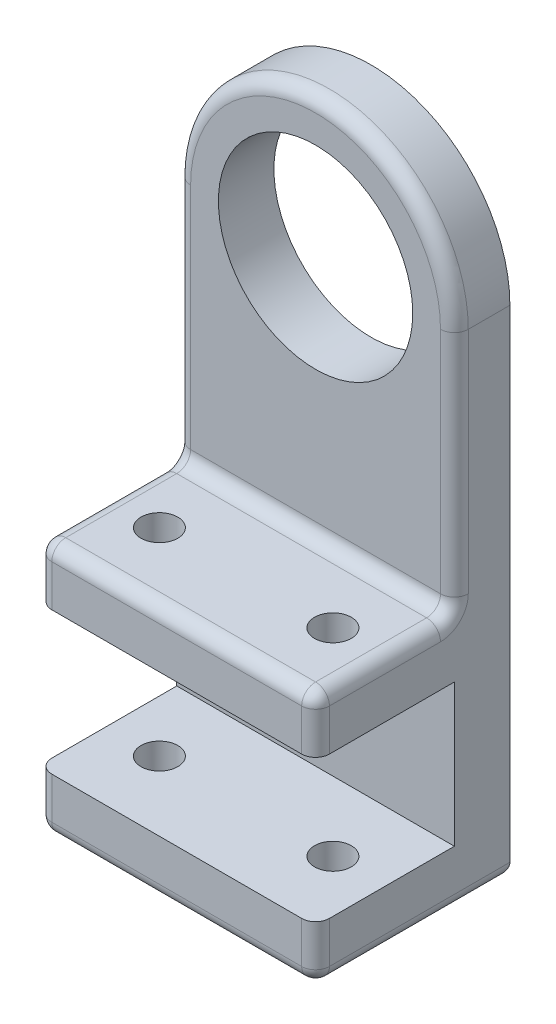
ISO-10303-21;
HEADER;
FILE_DESCRIPTION(('STEP AP214'),'2;1');
FILE_NAME('part.step','',(''),(''),'','','');
FILE_SCHEMA(('AUTOMOTIVE_DESIGN { 1 0 10303 214 1 1 1 1 }'));
ENDSEC;
DATA;
#1=APPLICATION_CONTEXT('core data for automotive mechanical design processes');
#2=APPLICATION_PROTOCOL_DEFINITION('international standard','automotive_design',2000,#1);
#3=PRODUCT_CONTEXT('',#1,'mechanical');
#4=PRODUCT('Part','Part','',(#3));
#5=PRODUCT_RELATED_PRODUCT_CATEGORY('part','',(#4));
#6=PRODUCT_DEFINITION_FORMATION('','',#4);
#7=PRODUCT_DEFINITION_CONTEXT('part definition',#1,'design');
#8=PRODUCT_DEFINITION('design','',#6,#7);
#9=PRODUCT_DEFINITION_SHAPE('','',#8);
#10=(LENGTH_UNIT() NAMED_UNIT(*) SI_UNIT(.MILLI.,.METRE.));
#11=(NAMED_UNIT(*) PLANE_ANGLE_UNIT() SI_UNIT($,.RADIAN.));
#12=(NAMED_UNIT(*) SI_UNIT($,.STERADIAN.) SOLID_ANGLE_UNIT());
#13=UNCERTAINTY_MEASURE_WITH_UNIT(LENGTH_MEASURE(1.E-05),#10,'distance_accuracy_value','');
#14=(GEOMETRIC_REPRESENTATION_CONTEXT(3) GLOBAL_UNCERTAINTY_ASSIGNED_CONTEXT((#13)) GLOBAL_UNIT_ASSIGNED_CONTEXT((#10,
#11,#12)) REPRESENTATION_CONTEXT('',''));
#15=CARTESIAN_POINT('',(0.,0.,0.));
#16=DIRECTION('',(0.,0.,1.));
#17=DIRECTION('',(1.,0.,0.));
#18=AXIS2_PLACEMENT_3D('',#15,#16,#17);
#19=CARTESIAN_POINT('',(0.,0.,8.));
#20=DIRECTION('',(0.,0.,-1.));
#21=DIRECTION('',(-1.,0.,0.));
#22=AXIS2_PLACEMENT_3D('',#19,#20,#21);
#23=PLANE('',#22);
#24=DIRECTION('',(-1.,0.,0.));
#25=VECTOR('',#24,1.);
#26=CARTESIAN_POINT('',(20.,-63.5,8.));
#27=LINE('',#26,#25);
#28=CARTESIAN_POINT('',(20.,-63.5,8.));
#29=VERTEX_POINT('',#28);
#30=CARTESIAN_POINT('',(-20.,-63.5,8.));
#31=VERTEX_POINT('',#30);
#32=EDGE_CURVE('E192',#29,#31,#27,.T.);
#33=ORIENTED_EDGE('',*,*,#32,.F.);
#34=DIRECTION('',(0.,1.,0.));
#35=VECTOR('',#34,1.);
#36=CARTESIAN_POINT('',(20.,-71.5,8.));
#37=LINE('',#36,#35);
#38=CARTESIAN_POINT('',(20.,-43.,8.));
#39=VERTEX_POINT('',#38);
#40=EDGE_CURVE('E201',#29,#39,#37,.T.);
#41=ORIENTED_EDGE('',*,*,#40,.T.);
#42=DIRECTION('',(1.,0.,0.));
#43=VECTOR('',#42,1.);
#44=CARTESIAN_POINT('',(-20.,-43.,8.));
#45=LINE('',#44,#43);
#46=CARTESIAN_POINT('',(-20.,-43.,8.));
#47=VERTEX_POINT('',#46);
#48=EDGE_CURVE('E213',#47,#39,#45,.T.);
#49=ORIENTED_EDGE('',*,*,#48,.F.);
#50=DIRECTION('',(0.,-1.,0.));
#51=VECTOR('',#50,1.);
#52=CARTESIAN_POINT('',(-20.,0.,8.));
#53=LINE('',#52,#51);
#54=EDGE_CURVE('E209',#47,#31,#53,.T.);
#55=ORIENTED_EDGE('',*,*,#54,.T.);
#56=EDGE_LOOP('',(#33,#41,#49,#55));
#57=FACE_BOUND('',#56,.T.);
#58=ADVANCED_FACE('F43',(#57),#23,.F.);
#59=CARTESIAN_POINT('',(0.,0.,8.));
#60=DIRECTION('',(0.,0.,-1.));
#61=DIRECTION('',(-1.,0.,0.));
#62=AXIS2_PLACEMENT_3D('',#59,#60,#61);
#63=CIRCLE('',#62,18.);
#64=CARTESIAN_POINT('',(18.,0.,8.));
#65=VERTEX_POINT('',#64);
#66=CARTESIAN_POINT('',(-18.,0.,8.));
#67=VERTEX_POINT('',#66);
#68=EDGE_CURVE('E281',#65,#67,#63,.F.);
#69=ORIENTED_EDGE('',*,*,#68,.T.);
#70=DIRECTION('',(0.,-1.,0.));
#71=VECTOR('',#70,1.);
#72=CARTESIAN_POINT('',(-18.,0.,8.));
#73=LINE('',#72,#71);
#74=CARTESIAN_POINT('',(-18.,-33.,8.));
#75=VERTEX_POINT('',#74);
#76=EDGE_CURVE('E283',#67,#75,#73,.T.);
#77=ORIENTED_EDGE('',*,*,#76,.T.);
#78=DIRECTION('',(-1.,0.,0.));
#79=VECTOR('',#78,1.);
#80=CARTESIAN_POINT('',(20.,-33.,8.));
#81=LINE('',#80,#79);
#82=CARTESIAN_POINT('',(18.,-33.,8.));
#83=VERTEX_POINT('',#82);
#84=EDGE_CURVE('E277',#75,#83,#81,.F.);
#85=ORIENTED_EDGE('',*,*,#84,.T.);
#86=DIRECTION('',(0.,1.,0.));
#87=VECTOR('',#86,1.);
#88=CARTESIAN_POINT('',(18.,0.,8.));
#89=LINE('',#88,#87);
#90=EDGE_CURVE('E279',#83,#65,#89,.T.);
#91=ORIENTED_EDGE('',*,*,#90,.T.);
#92=EDGE_LOOP('',(#69,#77,#85,#91));
#93=FACE_BOUND('',#92,.T.);
#94=CARTESIAN_POINT('',(0.,0.,8.));
#95=DIRECTION('',(0.,0.,1.));
#96=DIRECTION('',(1.,0.,0.));
#97=AXIS2_PLACEMENT_3D('',#94,#95,#96);
#98=CIRCLE('',#97,14.);
#99=CARTESIAN_POINT('',(14.,0.,8.));
#100=VERTEX_POINT('',#99);
#101=EDGE_CURVE('E227',#100,#100,#98,.T.);
#102=ORIENTED_EDGE('',*,*,#101,.F.);
#103=EDGE_LOOP('',(#102));
#104=FACE_BOUND('',#103,.T.);
#105=ADVANCED_FACE('F437',(#93,#104),#23,.F.);
#106=CARTESIAN_POINT('',(0.,0.,0.));
#107=DIRECTION('',(0.,0.,-1.));
#108=DIRECTION('',(-1.,0.,0.));
#109=AXIS2_PLACEMENT_3D('',#106,#107,#108);
#110=PLANE('',#109);
#111=DIRECTION('',(0.,1.,0.));
#112=VECTOR('',#111,1.);
#113=CARTESIAN_POINT('',(20.,-71.5,0.));
#114=LINE('',#113,#112);
#115=CARTESIAN_POINT('',(20.,-69.5,0.));
#116=VERTEX_POINT('',#115);
#117=CARTESIAN_POINT('',(20.,0.,0.));
#118=VERTEX_POINT('',#117);
#119=EDGE_CURVE('E233',#116,#118,#114,.T.);
#120=ORIENTED_EDGE('',*,*,#119,.F.);
#121=DIRECTION('',(1.,0.,0.));
#122=VECTOR('',#121,1.);
#123=CARTESIAN_POINT('',(-20.,-69.5,0.));
#124=LINE('',#123,#122);
#125=CARTESIAN_POINT('',(-20.,-69.5,0.));
#126=VERTEX_POINT('',#125);
#127=EDGE_CURVE('E11',#116,#126,#124,.F.);
#128=ORIENTED_EDGE('',*,*,#127,.T.);
#129=DIRECTION('',(0.,-1.,0.));
#130=VECTOR('',#129,1.);
#131=CARTESIAN_POINT('',(-20.,0.,0.));
#132=LINE('',#131,#130);
#133=CARTESIAN_POINT('',(-20.,0.,0.));
#134=VERTEX_POINT('',#133);
#135=EDGE_CURVE('E237',#134,#126,#132,.T.);
#136=ORIENTED_EDGE('',*,*,#135,.F.);
#137=CARTESIAN_POINT('',(0.,0.,0.));
#138=DIRECTION('',(0.,0.,1.));
#139=DIRECTION('',(-1.,0.,0.));
#140=AXIS2_PLACEMENT_3D('',#137,#138,#139);
#141=CIRCLE('',#140,20.);
#142=EDGE_CURVE('E230',#118,#134,#141,.T.);
#143=ORIENTED_EDGE('',*,*,#142,.F.);
#144=EDGE_LOOP('',(#120,#128,#136,#143));
#145=FACE_BOUND('',#144,.T.);
#146=CARTESIAN_POINT('',(0.,0.,0.));
#147=DIRECTION('',(0.,0.,1.));
#148=DIRECTION('',(1.,0.,0.));
#149=AXIS2_PLACEMENT_3D('',#146,#147,#148);
#150=CIRCLE('',#149,14.);
#151=CARTESIAN_POINT('',(14.,0.,0.));
#152=VERTEX_POINT('',#151);
#153=EDGE_CURVE('E226',#152,#152,#150,.T.);
#154=ORIENTED_EDGE('',*,*,#153,.T.);
#155=EDGE_LOOP('',(#154));
#156=FACE_BOUND('',#155,.T.);
#157=ADVANCED_FACE('F418',(#145,#156),#110,.T.);
#158=CARTESIAN_POINT('',(0.,0.,8.));
#159=DIRECTION('',(0.,0.,-1.));
#160=DIRECTION('',(-1.,0.,0.));
#161=AXIS2_PLACEMENT_3D('',#158,#159,#160);
#162=CYLINDRICAL_SURFACE('',#161,20.);
#163=DIRECTION('',(0.,0.,-1.));
#164=VECTOR('',#163,1.);
#165=CARTESIAN_POINT('',(-20.,0.,8.));
#166=LINE('',#165,#164);
#167=CARTESIAN_POINT('',(-20.,0.,6.));
#168=VERTEX_POINT('',#167);
#169=EDGE_CURVE('E243',#168,#134,#166,.T.);
#170=ORIENTED_EDGE('',*,*,#169,.F.);
#171=CARTESIAN_POINT('',(0.,0.,6.));
#172=DIRECTION('',(0.,0.,-1.));
#173=DIRECTION('',(-1.,0.,0.));
#174=AXIS2_PLACEMENT_3D('',#171,#172,#173);
#175=CIRCLE('',#174,20.);
#176=CARTESIAN_POINT('',(20.,0.,6.));
#177=VERTEX_POINT('',#176);
#178=EDGE_CURVE('E286',#168,#177,#175,.T.);
#179=ORIENTED_EDGE('',*,*,#178,.T.);
#180=DIRECTION('',(0.,0.,-1.));
#181=VECTOR('',#180,1.);
#182=CARTESIAN_POINT('',(20.,0.,8.));
#183=LINE('',#182,#181);
#184=EDGE_CURVE('E208',#177,#118,#183,.T.);
#185=ORIENTED_EDGE('',*,*,#184,.T.);
#186=ORIENTED_EDGE('',*,*,#142,.T.);
#187=EDGE_LOOP('',(#170,#179,#185,#186));
#188=FACE_BOUND('',#187,.T.);
#189=ADVANCED_FACE('F423',(#188),#162,.T.);
#190=CARTESIAN_POINT('',(-20.,0.,8.));
#191=DIRECTION('',(1.,0.,0.));
#192=DIRECTION('',(0.,1.,0.));
#193=AXIS2_PLACEMENT_3D('',#190,#191,#192);
#194=PLANE('',#193);
#195=ORIENTED_EDGE('',*,*,#135,.T.);
#196=DIRECTION('',(0.,0.,-1.));
#197=VECTOR('',#196,1.);
#198=CARTESIAN_POINT('',(-20.,-69.5,8.));
#199=LINE('',#198,#197);
#200=CARTESIAN_POINT('',(-20.,-69.5,26.));
#201=VERTEX_POINT('',#200);
#202=EDGE_CURVE('E265',#126,#201,#199,.F.);
#203=ORIENTED_EDGE('',*,*,#202,.T.);
#204=DIRECTION('',(0.,-1.,0.));
#205=VECTOR('',#204,1.);
#206=CARTESIAN_POINT('',(-20.,-63.5,26.));
#207=LINE('',#206,#205);
#208=CARTESIAN_POINT('',(-20.,-63.5,26.));
#209=VERTEX_POINT('',#208);
#210=EDGE_CURVE('E263',#201,#209,#207,.F.);
#211=ORIENTED_EDGE('',*,*,#210,.T.);
#212=DIRECTION('',(0.,0.,-1.));
#213=VECTOR('',#212,1.);
#214=CARTESIAN_POINT('',(-20.,-63.5,28.));
#215=LINE('',#214,#213);
#216=EDGE_CURVE('E197',#209,#31,#215,.T.);
#217=ORIENTED_EDGE('',*,*,#216,.T.);
#218=ORIENTED_EDGE('',*,*,#54,.F.);
#219=DIRECTION('',(0.,0.,-1.));
#220=VECTOR('',#219,1.);
#221=CARTESIAN_POINT('',(-20.,-43.,28.));
#222=LINE('',#221,#220);
#223=CARTESIAN_POINT('',(-20.,-43.,26.));
#224=VERTEX_POINT('',#223);
#225=EDGE_CURVE('E224',#224,#47,#222,.T.);
#226=ORIENTED_EDGE('',*,*,#225,.F.);
#227=DIRECTION('',(0.,-1.,0.));
#228=VECTOR('',#227,1.);
#229=CARTESIAN_POINT('',(-20.,-35.,26.));
#230=LINE('',#229,#228);
#231=CARTESIAN_POINT('',(-20.,-37.,26.));
#232=VERTEX_POINT('',#231);
#233=EDGE_CURVE('E245',#224,#232,#230,.F.);
#234=ORIENTED_EDGE('',*,*,#233,.T.);
#235=DIRECTION('',(0.,0.,-1.));
#236=VECTOR('',#235,1.);
#237=CARTESIAN_POINT('',(-20.,-37.,8.));
#238=LINE('',#237,#236);
#239=CARTESIAN_POINT('',(-20.,-37.,10.));
#240=VERTEX_POINT('',#239);
#241=EDGE_CURVE('E255',#232,#240,#238,.T.);
#242=ORIENTED_EDGE('',*,*,#241,.T.);
#243=CARTESIAN_POINT('',(-20.,-33.,10.));
#244=DIRECTION('',(1.,0.,0.));
#245=DIRECTION('',(0.,1.,0.));
#246=AXIS2_PLACEMENT_3D('',#243,#244,#245);
#247=CIRCLE('',#246,4.);
#248=CARTESIAN_POINT('',(-20.,-33.,6.));
#249=VERTEX_POINT('',#248);
#250=EDGE_CURVE('E258',#249,#240,#247,.F.);
#251=ORIENTED_EDGE('',*,*,#250,.F.);
#252=DIRECTION('',(0.,-1.,0.));
#253=VECTOR('',#252,1.);
#254=CARTESIAN_POINT('',(-20.,0.,6.));
#255=LINE('',#254,#253);
#256=EDGE_CURVE('E261',#249,#168,#255,.F.);
#257=ORIENTED_EDGE('',*,*,#256,.T.);
#258=ORIENTED_EDGE('',*,*,#169,.T.);
#259=EDGE_LOOP('',(#195,#203,#211,#217,#218,#226,#234,#242,#251,#257,#258));
#260=FACE_BOUND('',#259,.T.);
#261=ADVANCED_FACE('F488',(#260),#194,.F.);
#262=CARTESIAN_POINT('',(-20.,-71.5,8.));
#263=DIRECTION('',(0.,1.,0.));
#264=DIRECTION('',(0.,0.,1.));
#265=AXIS2_PLACEMENT_3D('',#262,#263,#264);
#266=PLANE('',#265);
#267=DIRECTION('',(1.,0.,0.));
#268=VECTOR('',#267,1.);
#269=CARTESIAN_POINT('',(-20.,-71.5,26.));
#270=LINE('',#269,#268);
#271=CARTESIAN_POINT('',(18.,-71.5,26.));
#272=VERTEX_POINT('',#271);
#273=CARTESIAN_POINT('',(-18.,-71.5,26.));
#274=VERTEX_POINT('',#273);
#275=EDGE_CURVE('E311',#272,#274,#270,.F.);
#276=ORIENTED_EDGE('',*,*,#275,.T.);
#277=DIRECTION('',(0.,0.,-1.));
#278=VECTOR('',#277,1.);
#279=CARTESIAN_POINT('',(-18.,-71.5,8.));
#280=LINE('',#279,#278);
#281=CARTESIAN_POINT('',(-18.,-71.5,2.));
#282=VERTEX_POINT('',#281);
#283=EDGE_CURVE('E313',#274,#282,#280,.T.);
#284=ORIENTED_EDGE('',*,*,#283,.T.);
#285=DIRECTION('',(1.,0.,0.));
#286=VECTOR('',#285,1.);
#287=CARTESIAN_POINT('',(20.,-71.5,2.));
#288=LINE('',#287,#286);
#289=CARTESIAN_POINT('',(18.,-71.5,2.));
#290=VERTEX_POINT('',#289);
#291=EDGE_CURVE('E307',#282,#290,#288,.T.);
#292=ORIENTED_EDGE('',*,*,#291,.T.);
#293=DIRECTION('',(0.,0.,-1.));
#294=VECTOR('',#293,1.);
#295=CARTESIAN_POINT('',(18.,-71.5,8.));
#296=LINE('',#295,#294);
#297=EDGE_CURVE('E309',#290,#272,#296,.F.);
#298=ORIENTED_EDGE('',*,*,#297,.T.);
#299=EDGE_LOOP('',(#276,#284,#292,#298));
#300=FACE_BOUND('',#299,.T.);
#301=CARTESIAN_POINT('',(-12.5,-71.5,18.));
#302=DIRECTION('',(0.,1.,0.));
#303=DIRECTION('',(0.,0.,1.));
#304=AXIS2_PLACEMENT_3D('',#301,#302,#303);
#305=CIRCLE('',#304,2.65);
#306=CARTESIAN_POINT('',(-12.5,-71.5,20.65));
#307=VERTEX_POINT('',#306);
#308=EDGE_CURVE('E250',#307,#307,#305,.T.);
#309=ORIENTED_EDGE('',*,*,#308,.T.);
#310=EDGE_LOOP('',(#309));
#311=FACE_BOUND('',#310,.T.);
#312=CARTESIAN_POINT('',(12.5,-71.5,18.));
#313=DIRECTION('',(0.,1.,0.));
#314=DIRECTION('',(0.,0.,1.));
#315=AXIS2_PLACEMENT_3D('',#312,#313,#314);
#316=CIRCLE('',#315,2.65);
#317=CARTESIAN_POINT('',(12.5,-71.5,20.65));
#318=VERTEX_POINT('',#317);
#319=EDGE_CURVE('E365',#318,#318,#316,.T.);
#320=ORIENTED_EDGE('',*,*,#319,.T.);
#321=EDGE_LOOP('',(#320));
#322=FACE_BOUND('',#321,.T.);
#323=ADVANCED_FACE('F406',(#300,#311,#322),#266,.F.);
#324=CARTESIAN_POINT('',(20.,-71.5,8.));
#325=DIRECTION('',(-1.,0.,0.));
#326=DIRECTION('',(0.,0.,1.));
#327=AXIS2_PLACEMENT_3D('',#324,#325,#326);
#328=PLANE('',#327);
#329=DIRECTION('',(0.,1.,0.));
#330=VECTOR('',#329,1.);
#331=CARTESIAN_POINT('',(20.,-71.5,26.));
#332=LINE('',#331,#330);
#333=CARTESIAN_POINT('',(20.,-63.5,26.));
#334=VERTEX_POINT('',#333);
#335=CARTESIAN_POINT('',(20.,-69.5,26.));
#336=VERTEX_POINT('',#335);
#337=EDGE_CURVE('E297',#334,#336,#332,.F.);
#338=ORIENTED_EDGE('',*,*,#337,.T.);
#339=DIRECTION('',(0.,0.,-1.));
#340=VECTOR('',#339,1.);
#341=CARTESIAN_POINT('',(20.,-69.5,8.));
#342=LINE('',#341,#340);
#343=EDGE_CURVE('E299',#336,#116,#342,.T.);
#344=ORIENTED_EDGE('',*,*,#343,.T.);
#345=ORIENTED_EDGE('',*,*,#119,.T.);
#346=ORIENTED_EDGE('',*,*,#184,.F.);
#347=DIRECTION('',(0.,1.,0.));
#348=VECTOR('',#347,1.);
#349=CARTESIAN_POINT('',(20.,-71.5,6.));
#350=LINE('',#349,#348);
#351=CARTESIAN_POINT('',(20.,-33.,6.));
#352=VERTEX_POINT('',#351);
#353=EDGE_CURVE('E295',#177,#352,#350,.F.);
#354=ORIENTED_EDGE('',*,*,#353,.T.);
#355=CARTESIAN_POINT('',(20.,-33.,10.));
#356=DIRECTION('',(-1.,0.,0.));
#357=DIRECTION('',(0.,0.,1.));
#358=AXIS2_PLACEMENT_3D('',#355,#356,#357);
#359=CIRCLE('',#358,4.);
#360=CARTESIAN_POINT('',(20.,-37.,10.));
#361=VERTEX_POINT('',#360);
#362=EDGE_CURVE('E292',#361,#352,#359,.F.);
#363=ORIENTED_EDGE('',*,*,#362,.F.);
#364=DIRECTION('',(0.,0.,-1.));
#365=VECTOR('',#364,1.);
#366=CARTESIAN_POINT('',(20.,-37.,8.));
#367=LINE('',#366,#365);
#368=CARTESIAN_POINT('',(20.,-37.,26.));
#369=VERTEX_POINT('',#368);
#370=EDGE_CURVE('E290',#361,#369,#367,.F.);
#371=ORIENTED_EDGE('',*,*,#370,.T.);
#372=DIRECTION('',(0.,1.,0.));
#373=VECTOR('',#372,1.);
#374=CARTESIAN_POINT('',(20.,-43.,26.));
#375=LINE('',#374,#373);
#376=CARTESIAN_POINT('',(20.,-43.,26.));
#377=VERTEX_POINT('',#376);
#378=EDGE_CURVE('E288',#369,#377,#375,.F.);
#379=ORIENTED_EDGE('',*,*,#378,.T.);
#380=DIRECTION('',(0.,0.,-1.));
#381=VECTOR('',#380,1.);
#382=CARTESIAN_POINT('',(20.,-43.,28.));
#383=LINE('',#382,#381);
#384=EDGE_CURVE('E204',#377,#39,#383,.T.);
#385=ORIENTED_EDGE('',*,*,#384,.T.);
#386=ORIENTED_EDGE('',*,*,#40,.F.);
#387=DIRECTION('',(0.,0.,-1.));
#388=VECTOR('',#387,1.);
#389=CARTESIAN_POINT('',(20.,-63.5,28.));
#390=LINE('',#389,#388);
#391=EDGE_CURVE('E186',#334,#29,#390,.T.);
#392=ORIENTED_EDGE('',*,*,#391,.F.);
#393=EDGE_LOOP('',(#338,#344,#345,#346,#354,#363,#371,#379,#385,#386,#392));
#394=FACE_BOUND('',#393,.T.);
#395=ADVANCED_FACE('F202',(#394),#328,.F.);
#396=CARTESIAN_POINT('',(0.,0.,8.));
#397=DIRECTION('',(0.,0.,-1.));
#398=DIRECTION('',(-1.,0.,0.));
#399=AXIS2_PLACEMENT_3D('',#396,#397,#398);
#400=CYLINDRICAL_SURFACE('',#399,14.);
#401=ORIENTED_EDGE('',*,*,#101,.T.);
#402=EDGE_LOOP('',(#401));
#403=FACE_BOUND('',#402,.T.);
#404=ORIENTED_EDGE('',*,*,#153,.F.);
#405=EDGE_LOOP('',(#404));
#406=FACE_BOUND('',#405,.T.);
#407=ADVANCED_FACE('F512',(#403,#406),#400,.F.);
#408=CARTESIAN_POINT('',(-20.,-43.,28.));
#409=DIRECTION('',(0.,1.,0.));
#410=DIRECTION('',(0.,0.,1.));
#411=AXIS2_PLACEMENT_3D('',#408,#409,#410);
#412=PLANE('',#411);
#413=CARTESIAN_POINT('',(-12.5,-43.,18.));
#414=DIRECTION('',(0.,1.,0.));
#415=DIRECTION('',(0.,0.,1.));
#416=AXIS2_PLACEMENT_3D('',#413,#414,#415);
#417=CIRCLE('',#416,2.65);
#418=CARTESIAN_POINT('',(-12.5,-43.,20.65));
#419=VERTEX_POINT('',#418);
#420=EDGE_CURVE('E198',#419,#419,#417,.T.);
#421=ORIENTED_EDGE('',*,*,#420,.T.);
#422=EDGE_LOOP('',(#421));
#423=FACE_BOUND('',#422,.T.);
#424=CARTESIAN_POINT('',(12.5,-43.,18.));
#425=DIRECTION('',(0.,1.,0.));
#426=DIRECTION('',(0.,0.,1.));
#427=AXIS2_PLACEMENT_3D('',#424,#425,#426);
#428=CIRCLE('',#427,2.65);
#429=CARTESIAN_POINT('',(12.5,-43.,20.65));
#430=VERTEX_POINT('',#429);
#431=EDGE_CURVE('E249',#430,#430,#428,.T.);
#432=ORIENTED_EDGE('',*,*,#431,.T.);
#433=EDGE_LOOP('',(#432));
#434=FACE_BOUND('',#433,.T.);
#435=ORIENTED_EDGE('',*,*,#384,.F.);
#436=CARTESIAN_POINT('',(18.,-43.,26.));
#437=DIRECTION('',(0.,1.,0.));
#438=DIRECTION('',(0.,0.,1.));
#439=AXIS2_PLACEMENT_3D('',#436,#437,#438);
#440=CIRCLE('',#439,2.);
#441=CARTESIAN_POINT('',(18.,-43.,28.));
#442=VERTEX_POINT('',#441);
#443=EDGE_CURVE('E52',#377,#442,#440,.F.);
#444=ORIENTED_EDGE('',*,*,#443,.T.);
#445=DIRECTION('',(1.,0.,0.));
#446=VECTOR('',#445,1.);
#447=CARTESIAN_POINT('',(-20.,-43.,28.));
#448=LINE('',#447,#446);
#449=CARTESIAN_POINT('',(-18.,-43.,28.));
#450=VERTEX_POINT('',#449);
#451=EDGE_CURVE('E216',#450,#442,#448,.T.);
#452=ORIENTED_EDGE('',*,*,#451,.F.);
#453=CARTESIAN_POINT('',(-18.,-43.,26.));
#454=DIRECTION('',(0.,1.,0.));
#455=DIRECTION('',(0.,0.,1.));
#456=AXIS2_PLACEMENT_3D('',#453,#454,#455);
#457=CIRCLE('',#456,2.);
#458=EDGE_CURVE('E323',#450,#224,#457,.F.);
#459=ORIENTED_EDGE('',*,*,#458,.T.);
#460=ORIENTED_EDGE('',*,*,#225,.T.);
#461=ORIENTED_EDGE('',*,*,#48,.T.);
#462=EDGE_LOOP('',(#435,#444,#452,#459,#460,#461));
#463=FACE_BOUND('',#462,.T.);
#464=ADVANCED_FACE('F467',(#423,#434,#463),#412,.F.);
#465=CARTESIAN_POINT('',(-20.,-35.,28.));
#466=DIRECTION('',(0.,-1.,0.));
#467=DIRECTION('',(0.,0.,-1.));
#468=AXIS2_PLACEMENT_3D('',#465,#466,#467);
#469=PLANE('',#468);
#470=DIRECTION('',(-1.,0.,0.));
#471=VECTOR('',#470,1.);
#472=CARTESIAN_POINT('',(-20.,-35.,10.));
#473=LINE('',#472,#471);
#474=CARTESIAN_POINT('',(18.,-35.,10.));
#475=VERTEX_POINT('',#474);
#476=CARTESIAN_POINT('',(-18.,-35.,10.));
#477=VERTEX_POINT('',#476);
#478=EDGE_CURVE('E268',#475,#477,#473,.T.);
#479=ORIENTED_EDGE('',*,*,#478,.T.);
#480=DIRECTION('',(0.,0.,-1.));
#481=VECTOR('',#480,1.);
#482=CARTESIAN_POINT('',(-18.,-35.,28.));
#483=LINE('',#482,#481);
#484=CARTESIAN_POINT('',(-18.,-35.,26.));
#485=VERTEX_POINT('',#484);
#486=EDGE_CURVE('E274',#477,#485,#483,.F.);
#487=ORIENTED_EDGE('',*,*,#486,.T.);
#488=DIRECTION('',(-1.,0.,0.));
#489=VECTOR('',#488,1.);
#490=CARTESIAN_POINT('',(20.,-35.,26.));
#491=LINE('',#490,#489);
#492=CARTESIAN_POINT('',(18.,-35.,26.));
#493=VERTEX_POINT('',#492);
#494=EDGE_CURVE('E272',#485,#493,#491,.F.);
#495=ORIENTED_EDGE('',*,*,#494,.T.);
#496=DIRECTION('',(0.,0.,-1.));
#497=VECTOR('',#496,1.);
#498=CARTESIAN_POINT('',(18.,-35.,28.));
#499=LINE('',#498,#497);
#500=EDGE_CURVE('E270',#493,#475,#499,.T.);
#501=ORIENTED_EDGE('',*,*,#500,.T.);
#502=EDGE_LOOP('',(#479,#487,#495,#501));
#503=FACE_BOUND('',#502,.T.);
#504=CARTESIAN_POINT('',(-12.5,-35.,18.));
#505=DIRECTION('',(0.,1.,0.));
#506=DIRECTION('',(0.,0.,1.));
#507=AXIS2_PLACEMENT_3D('',#504,#505,#506);
#508=CIRCLE('',#507,2.65);
#509=CARTESIAN_POINT('',(-12.5,-35.,20.65));
#510=VERTEX_POINT('',#509);
#511=EDGE_CURVE('E615',#510,#510,#508,.T.);
#512=ORIENTED_EDGE('',*,*,#511,.F.);
#513=EDGE_LOOP('',(#512));
#514=FACE_BOUND('',#513,.T.);
#515=CARTESIAN_POINT('',(12.5,-35.,18.));
#516=DIRECTION('',(0.,1.,0.));
#517=DIRECTION('',(0.,0.,1.));
#518=AXIS2_PLACEMENT_3D('',#515,#516,#517);
#519=CIRCLE('',#518,2.65);
#520=CARTESIAN_POINT('',(12.5,-35.,20.65));
#521=VERTEX_POINT('',#520);
#522=EDGE_CURVE('E612',#521,#521,#519,.T.);
#523=ORIENTED_EDGE('',*,*,#522,.F.);
#524=EDGE_LOOP('',(#523));
#525=FACE_BOUND('',#524,.T.);
#526=ADVANCED_FACE('F449',(#503,#514,#525),#469,.F.);
#527=CARTESIAN_POINT('',(0.,0.,28.));
#528=DIRECTION('',(0.,0.,1.));
#529=DIRECTION('',(1.,0.,0.));
#530=AXIS2_PLACEMENT_3D('',#527,#528,#529);
#531=PLANE('',#530);
#532=ORIENTED_EDGE('',*,*,#451,.T.);
#533=DIRECTION('',(0.,1.,0.));
#534=VECTOR('',#533,1.);
#535=CARTESIAN_POINT('',(18.,-35.,28.));
#536=LINE('',#535,#534);
#537=CARTESIAN_POINT('',(18.,-37.,28.));
#538=VERTEX_POINT('',#537);
#539=EDGE_CURVE('E305',#442,#538,#536,.T.);
#540=ORIENTED_EDGE('',*,*,#539,.T.);
#541=DIRECTION('',(-1.,0.,0.));
#542=VECTOR('',#541,1.);
#543=CARTESIAN_POINT('',(-20.,-37.,28.));
#544=LINE('',#543,#542);
#545=CARTESIAN_POINT('',(-18.,-37.,28.));
#546=VERTEX_POINT('',#545);
#547=EDGE_CURVE('E303',#538,#546,#544,.T.);
#548=ORIENTED_EDGE('',*,*,#547,.T.);
#549=DIRECTION('',(0.,-1.,0.));
#550=VECTOR('',#549,1.);
#551=CARTESIAN_POINT('',(-18.,-43.,28.));
#552=LINE('',#551,#550);
#553=EDGE_CURVE('E301',#546,#450,#552,.T.);
#554=ORIENTED_EDGE('',*,*,#553,.T.);
#555=EDGE_LOOP('',(#532,#540,#548,#554));
#556=FACE_BOUND('',#555,.T.);
#557=ADVANCED_FACE('F470',(#556),#531,.T.);
#558=CARTESIAN_POINT('',(20.,-63.5,28.));
#559=DIRECTION('',(0.,-1.,0.));
#560=DIRECTION('',(0.,0.,-1.));
#561=AXIS2_PLACEMENT_3D('',#558,#559,#560);
#562=PLANE('',#561);
#563=CARTESIAN_POINT('',(-12.5,-63.5,18.));
#564=DIRECTION('',(0.,-1.,0.));
#565=DIRECTION('',(0.,0.,-1.));
#566=AXIS2_PLACEMENT_3D('',#563,#564,#565);
#567=CIRCLE('',#566,2.65);
#568=CARTESIAN_POINT('',(-12.5,-63.5,15.35));
#569=VERTEX_POINT('',#568);
#570=EDGE_CURVE('E251',#569,#569,#567,.T.);
#571=ORIENTED_EDGE('',*,*,#570,.T.);
#572=EDGE_LOOP('',(#571));
#573=FACE_BOUND('',#572,.T.);
#574=CARTESIAN_POINT('',(12.5,-63.5,18.));
#575=DIRECTION('',(0.,-1.,0.));
#576=DIRECTION('',(0.,0.,-1.));
#577=AXIS2_PLACEMENT_3D('',#574,#575,#576);
#578=CIRCLE('',#577,2.65);
#579=CARTESIAN_POINT('',(12.5,-63.5,15.35));
#580=VERTEX_POINT('',#579);
#581=EDGE_CURVE('E246',#580,#580,#578,.T.);
#582=ORIENTED_EDGE('',*,*,#581,.T.);
#583=EDGE_LOOP('',(#582));
#584=FACE_BOUND('',#583,.T.);
#585=DIRECTION('',(-1.,0.,0.));
#586=VECTOR('',#585,1.);
#587=CARTESIAN_POINT('',(20.,-63.5,28.));
#588=LINE('',#587,#586);
#589=CARTESIAN_POINT('',(18.,-63.5,28.));
#590=VERTEX_POINT('',#589);
#591=CARTESIAN_POINT('',(-18.,-63.5,28.));
#592=VERTEX_POINT('',#591);
#593=EDGE_CURVE('E214',#590,#592,#588,.T.);
#594=ORIENTED_EDGE('',*,*,#593,.F.);
#595=CARTESIAN_POINT('',(18.,-63.5,26.));
#596=DIRECTION('',(0.,-1.,0.));
#597=DIRECTION('',(0.,0.,-1.));
#598=AXIS2_PLACEMENT_3D('',#595,#596,#597);
#599=CIRCLE('',#598,2.);
#600=EDGE_CURVE('E194',#590,#334,#599,.F.);
#601=ORIENTED_EDGE('',*,*,#600,.T.);
#602=ORIENTED_EDGE('',*,*,#391,.T.);
#603=ORIENTED_EDGE('',*,*,#32,.T.);
#604=ORIENTED_EDGE('',*,*,#216,.F.);
#605=CARTESIAN_POINT('',(-18.,-63.5,26.));
#606=DIRECTION('',(0.,-1.,0.));
#607=DIRECTION('',(0.,0.,-1.));
#608=AXIS2_PLACEMENT_3D('',#605,#606,#607);
#609=CIRCLE('',#608,2.);
#610=EDGE_CURVE('E320',#209,#592,#609,.F.);
#611=ORIENTED_EDGE('',*,*,#610,.T.);
#612=EDGE_LOOP('',(#594,#601,#602,#603,#604,#611));
#613=FACE_BOUND('',#612,.T.);
#614=ADVANCED_FACE('F189',(#573,#584,#613),#562,.F.);
#615=CARTESIAN_POINT('',(0.,0.,28.));
#616=DIRECTION('',(0.,0.,1.));
#617=DIRECTION('',(1.,0.,0.));
#618=AXIS2_PLACEMENT_3D('',#615,#616,#617);
#619=PLANE('',#618);
#620=DIRECTION('',(1.,0.,0.));
#621=VECTOR('',#620,1.);
#622=CARTESIAN_POINT('',(20.,-69.5,28.));
#623=LINE('',#622,#621);
#624=CARTESIAN_POINT('',(-18.,-69.5,28.));
#625=VERTEX_POINT('',#624);
#626=CARTESIAN_POINT('',(18.,-69.5,28.));
#627=VERTEX_POINT('',#626);
#628=EDGE_CURVE('E60',#625,#627,#623,.T.);
#629=ORIENTED_EDGE('',*,*,#628,.T.);
#630=DIRECTION('',(0.,1.,0.));
#631=VECTOR('',#630,1.);
#632=CARTESIAN_POINT('',(18.,-63.5,28.));
#633=LINE('',#632,#631);
#634=EDGE_CURVE('E318',#627,#590,#633,.T.);
#635=ORIENTED_EDGE('',*,*,#634,.T.);
#636=ORIENTED_EDGE('',*,*,#593,.T.);
#637=DIRECTION('',(0.,-1.,0.));
#638=VECTOR('',#637,1.);
#639=CARTESIAN_POINT('',(-18.,-71.5,28.));
#640=LINE('',#639,#638);
#641=EDGE_CURVE('E65',#592,#625,#640,.T.);
#642=ORIENTED_EDGE('',*,*,#641,.T.);
#643=EDGE_LOOP('',(#629,#635,#636,#642));
#644=FACE_BOUND('',#643,.T.);
#645=ADVANCED_FACE('F393',(#644),#619,.T.);
#646=CARTESIAN_POINT('',(12.5,-71.5,18.));
#647=DIRECTION('',(0.,1.,0.));
#648=DIRECTION('',(0.,0.,1.));
#649=AXIS2_PLACEMENT_3D('',#646,#647,#648);
#650=CYLINDRICAL_SURFACE('',#649,2.65);
#651=ORIENTED_EDGE('',*,*,#319,.F.);
#652=EDGE_LOOP('',(#651));
#653=FACE_BOUND('',#652,.T.);
#654=ORIENTED_EDGE('',*,*,#581,.F.);
#655=EDGE_LOOP('',(#654));
#656=FACE_BOUND('',#655,.T.);
#657=ADVANCED_FACE('F568',(#653,#656),#650,.F.);
#658=CARTESIAN_POINT('',(-12.5,-71.5,18.));
#659=DIRECTION('',(0.,1.,0.));
#660=DIRECTION('',(0.,0.,1.));
#661=AXIS2_PLACEMENT_3D('',#658,#659,#660);
#662=CYLINDRICAL_SURFACE('',#661,2.65);
#663=ORIENTED_EDGE('',*,*,#308,.F.);
#664=EDGE_LOOP('',(#663));
#665=FACE_BOUND('',#664,.T.);
#666=ORIENTED_EDGE('',*,*,#570,.F.);
#667=EDGE_LOOP('',(#666));
#668=FACE_BOUND('',#667,.T.);
#669=ADVANCED_FACE('F562',(#665,#668),#662,.F.);
#670=ORIENTED_EDGE('',*,*,#522,.T.);
#671=EDGE_LOOP('',(#670));
#672=FACE_BOUND('',#671,.T.);
#673=ORIENTED_EDGE('',*,*,#431,.F.);
#674=EDGE_LOOP('',(#673));
#675=FACE_BOUND('',#674,.T.);
#676=ADVANCED_FACE('F559',(#672,#675),#650,.F.);
#677=ORIENTED_EDGE('',*,*,#511,.T.);
#678=EDGE_LOOP('',(#677));
#679=FACE_BOUND('',#678,.T.);
#680=ORIENTED_EDGE('',*,*,#420,.F.);
#681=EDGE_LOOP('',(#680));
#682=FACE_BOUND('',#681,.T.);
#683=ADVANCED_FACE('F555',(#679,#682),#662,.F.);
#684=CARTESIAN_POINT('',(18.,0.,26.));
#685=DIRECTION('',(0.,-1.,0.));
#686=DIRECTION('',(0.,0.,-1.));
#687=AXIS2_PLACEMENT_3D('',#684,#685,#686);
#688=CYLINDRICAL_SURFACE('',#687,2.);
#689=ORIENTED_EDGE('',*,*,#443,.F.);
#690=ORIENTED_EDGE('',*,*,#378,.F.);
#691=CARTESIAN_POINT('',(18.,-37.,26.));
#692=DIRECTION('',(0.,1.,0.));
#693=DIRECTION('',(0.,0.,1.));
#694=AXIS2_PLACEMENT_3D('',#691,#692,#693);
#695=CIRCLE('',#694,2.);
#696=EDGE_CURVE('E359',#538,#369,#695,.T.);
#697=ORIENTED_EDGE('',*,*,#696,.F.);
#698=ORIENTED_EDGE('',*,*,#539,.F.);
#699=EDGE_LOOP('',(#689,#690,#697,#698));
#700=FACE_BOUND('',#699,.T.);
#701=ADVANCED_FACE('F462',(#700),#688,.T.);
#702=CARTESIAN_POINT('',(18.,0.,6.));
#703=DIRECTION('',(0.,1.,0.));
#704=DIRECTION('',(0.,0.,1.));
#705=AXIS2_PLACEMENT_3D('',#702,#703,#704);
#706=CYLINDRICAL_SURFACE('',#705,2.);
#707=CARTESIAN_POINT('',(18.,-33.,6.));
#708=DIRECTION('',(0.,-1.,0.));
#709=DIRECTION('',(0.,0.,-1.));
#710=AXIS2_PLACEMENT_3D('',#707,#708,#709);
#711=CIRCLE('',#710,2.);
#712=EDGE_CURVE('E353',#352,#83,#711,.T.);
#713=ORIENTED_EDGE('',*,*,#712,.F.);
#714=ORIENTED_EDGE('',*,*,#353,.F.);
#715=CARTESIAN_POINT('',(18.,0.,6.));
#716=DIRECTION('',(0.,1.,0.));
#717=DIRECTION('',(0.,0.,1.));
#718=AXIS2_PLACEMENT_3D('',#715,#716,#717);
#719=CIRCLE('',#718,2.);
#720=EDGE_CURVE('E356',#65,#177,#719,.T.);
#721=ORIENTED_EDGE('',*,*,#720,.F.);
#722=ORIENTED_EDGE('',*,*,#90,.F.);
#723=EDGE_LOOP('',(#713,#714,#721,#722));
#724=FACE_BOUND('',#723,.T.);
#725=ADVANCED_FACE('F429',(#724),#706,.T.);
#726=CARTESIAN_POINT('',(18.,-37.,28.));
#727=DIRECTION('',(0.,0.,-1.));
#728=DIRECTION('',(-1.,0.,0.));
#729=AXIS2_PLACEMENT_3D('',#726,#727,#728);
#730=CYLINDRICAL_SURFACE('',#729,2.);
#731=CARTESIAN_POINT('',(18.,-37.,26.));
#732=DIRECTION('',(0.,0.,1.));
#733=DIRECTION('',(1.,0.,0.));
#734=AXIS2_PLACEMENT_3D('',#731,#732,#733);
#735=CIRCLE('',#734,2.);
#736=EDGE_CURVE('E362',#369,#493,#735,.T.);
#737=ORIENTED_EDGE('',*,*,#736,.F.);
#738=ORIENTED_EDGE('',*,*,#370,.F.);
#739=CARTESIAN_POINT('',(18.,-37.,10.));
#740=DIRECTION('',(0.,0.,-1.));
#741=DIRECTION('',(-1.,0.,0.));
#742=AXIS2_PLACEMENT_3D('',#739,#740,#741);
#743=CIRCLE('',#742,2.);
#744=EDGE_CURVE('E350',#475,#361,#743,.T.);
#745=ORIENTED_EDGE('',*,*,#744,.F.);
#746=ORIENTED_EDGE('',*,*,#500,.F.);
#747=EDGE_LOOP('',(#737,#738,#745,#746));
#748=FACE_BOUND('',#747,.T.);
#749=ADVANCED_FACE('F457',(#748),#730,.T.);
#750=CARTESIAN_POINT('',(18.,-37.,26.));
#751=DIRECTION('',(1.,0.,0.));
#752=DIRECTION('',(0.,0.,-1.));
#753=AXIS2_PLACEMENT_3D('',#750,#751,#752);
#754=SPHERICAL_SURFACE('',#753,2.);
#755=ORIENTED_EDGE('',*,*,#696,.T.);
#756=ORIENTED_EDGE('',*,*,#736,.T.);
#757=CARTESIAN_POINT('',(18.,-37.,26.));
#758=DIRECTION('',(1.,0.,0.));
#759=DIRECTION('',(0.,0.,-1.));
#760=AXIS2_PLACEMENT_3D('',#757,#758,#759);
#761=CIRCLE('',#760,2.);
#762=EDGE_CURVE('E347',#538,#493,#761,.F.);
#763=ORIENTED_EDGE('',*,*,#762,.F.);
#764=EDGE_LOOP('',(#755,#756,#763));
#765=FACE_BOUND('',#764,.T.);
#766=ADVANCED_FACE('F546',(#765),#754,.T.);
#767=CARTESIAN_POINT('',(0.,0.,6.));
#768=DIRECTION('',(0.,0.,-1.));
#769=DIRECTION('',(-1.,0.,0.));
#770=AXIS2_PLACEMENT_3D('',#767,#768,#769);
#771=TOROIDAL_SURFACE('',#770,18.,2.);
#772=ORIENTED_EDGE('',*,*,#720,.T.);
#773=ORIENTED_EDGE('',*,*,#178,.F.);
#774=CARTESIAN_POINT('',(-18.,0.,6.));
#775=DIRECTION('',(0.,-1.,0.));
#776=DIRECTION('',(1.,0.,0.));
#777=AXIS2_PLACEMENT_3D('',#774,#775,#776);
#778=CIRCLE('',#777,2.);
#779=EDGE_CURVE('E344',#67,#168,#778,.T.);
#780=ORIENTED_EDGE('',*,*,#779,.F.);
#781=ORIENTED_EDGE('',*,*,#68,.F.);
#782=EDGE_LOOP('',(#772,#773,#780,#781));
#783=FACE_BOUND('',#782,.T.);
#784=ADVANCED_FACE('F433',(#783),#771,.T.);
#785=CARTESIAN_POINT('',(18.,-33.,10.));
#786=DIRECTION('',(-1.,0.,0.));
#787=DIRECTION('',(0.,0.,1.));
#788=AXIS2_PLACEMENT_3D('',#785,#786,#787);
#789=TOROIDAL_SURFACE('',#788,4.,2.);
#790=ORIENTED_EDGE('',*,*,#362,.T.);
#791=ORIENTED_EDGE('',*,*,#712,.T.);
#792=CARTESIAN_POINT('',(18.,-33.,10.));
#793=DIRECTION('',(-1.,0.,0.));
#794=DIRECTION('',(0.,0.,1.));
#795=AXIS2_PLACEMENT_3D('',#792,#793,#794);
#796=CIRCLE('',#795,2.);
#797=EDGE_CURVE('E341',#475,#83,#796,.F.);
#798=ORIENTED_EDGE('',*,*,#797,.F.);
#799=ORIENTED_EDGE('',*,*,#744,.T.);
#800=EDGE_LOOP('',(#790,#791,#798,#799));
#801=FACE_BOUND('',#800,.T.);
#802=ADVANCED_FACE('F442',(#801),#789,.T.);
#803=CARTESIAN_POINT('',(0.,-37.,26.));
#804=DIRECTION('',(1.,0.,0.));
#805=DIRECTION('',(0.,0.,-1.));
#806=AXIS2_PLACEMENT_3D('',#803,#804,#805);
#807=CYLINDRICAL_SURFACE('',#806,2.);
#808=ORIENTED_EDGE('',*,*,#762,.T.);
#809=ORIENTED_EDGE('',*,*,#494,.F.);
#810=CARTESIAN_POINT('',(-18.,-37.,26.));
#811=DIRECTION('',(-1.,0.,0.));
#812=DIRECTION('',(0.,0.,1.));
#813=AXIS2_PLACEMENT_3D('',#810,#811,#812);
#814=CIRCLE('',#813,2.);
#815=EDGE_CURVE('E338',#546,#485,#814,.T.);
#816=ORIENTED_EDGE('',*,*,#815,.F.);
#817=ORIENTED_EDGE('',*,*,#547,.F.);
#818=EDGE_LOOP('',(#808,#809,#816,#817));
#819=FACE_BOUND('',#818,.T.);
#820=ADVANCED_FACE('F480',(#819),#807,.T.);
#821=CARTESIAN_POINT('',(-18.,0.,26.));
#822=DIRECTION('',(0.,1.,0.));
#823=DIRECTION('',(-1.,0.,0.));
#824=AXIS2_PLACEMENT_3D('',#821,#822,#823);
#825=CYLINDRICAL_SURFACE('',#824,2.);
#826=ORIENTED_EDGE('',*,*,#458,.F.);
#827=ORIENTED_EDGE('',*,*,#553,.F.);
#828=CARTESIAN_POINT('',(-18.,-37.,26.));
#829=DIRECTION('',(0.,1.,0.));
#830=DIRECTION('',(0.,0.,1.));
#831=AXIS2_PLACEMENT_3D('',#828,#829,#830);
#832=CIRCLE('',#831,2.);
#833=EDGE_CURVE('E335',#232,#546,#832,.T.);
#834=ORIENTED_EDGE('',*,*,#833,.F.);
#835=ORIENTED_EDGE('',*,*,#233,.F.);
#836=EDGE_LOOP('',(#826,#827,#834,#835));
#837=FACE_BOUND('',#836,.T.);
#838=ADVANCED_FACE('F476',(#837),#825,.T.);
#839=CARTESIAN_POINT('',(-18.,0.,6.));
#840=DIRECTION('',(0.,-1.,0.));
#841=DIRECTION('',(1.,0.,0.));
#842=AXIS2_PLACEMENT_3D('',#839,#840,#841);
#843=CYLINDRICAL_SURFACE('',#842,2.);
#844=ORIENTED_EDGE('',*,*,#779,.T.);
#845=ORIENTED_EDGE('',*,*,#256,.F.);
#846=CARTESIAN_POINT('',(-18.,-33.,6.));
#847=DIRECTION('',(0.,-1.,0.));
#848=DIRECTION('',(0.,0.,-1.));
#849=AXIS2_PLACEMENT_3D('',#846,#847,#848);
#850=CIRCLE('',#849,2.);
#851=EDGE_CURVE('E332',#75,#249,#850,.T.);
#852=ORIENTED_EDGE('',*,*,#851,.F.);
#853=ORIENTED_EDGE('',*,*,#76,.F.);
#854=EDGE_LOOP('',(#844,#845,#852,#853));
#855=FACE_BOUND('',#854,.T.);
#856=ADVANCED_FACE('F534',(#855),#843,.T.);
#857=CARTESIAN_POINT('',(-20.,-33.,10.));
#858=DIRECTION('',(1.,0.,0.));
#859=DIRECTION('',(0.,0.,-1.));
#860=AXIS2_PLACEMENT_3D('',#857,#858,#859);
#861=CYLINDRICAL_SURFACE('',#860,2.);
#862=ORIENTED_EDGE('',*,*,#797,.T.);
#863=ORIENTED_EDGE('',*,*,#84,.F.);
#864=CARTESIAN_POINT('',(-18.,-33.,10.));
#865=DIRECTION('',(1.,0.,0.));
#866=DIRECTION('',(0.,1.,0.));
#867=AXIS2_PLACEMENT_3D('',#864,#865,#866);
#868=CIRCLE('',#867,2.);
#869=EDGE_CURVE('E330',#477,#75,#868,.T.);
#870=ORIENTED_EDGE('',*,*,#869,.F.);
#871=ORIENTED_EDGE('',*,*,#478,.F.);
#872=EDGE_LOOP('',(#862,#863,#870,#871));
#873=FACE_BOUND('',#872,.T.);
#874=ADVANCED_FACE('F445',(#873),#861,.F.);
#875=CARTESIAN_POINT('',(-18.,-37.,26.));
#876=DIRECTION('',(0.,0.,1.));
#877=DIRECTION('',(1.,0.,0.));
#878=AXIS2_PLACEMENT_3D('',#875,#876,#877);
#879=SPHERICAL_SURFACE('',#878,2.);
#880=ORIENTED_EDGE('',*,*,#833,.T.);
#881=ORIENTED_EDGE('',*,*,#815,.T.);
#882=CARTESIAN_POINT('',(-18.,-37.,26.));
#883=DIRECTION('',(0.,0.,1.));
#884=DIRECTION('',(1.,0.,0.));
#885=AXIS2_PLACEMENT_3D('',#882,#883,#884);
#886=CIRCLE('',#885,2.);
#887=EDGE_CURVE('E328',#232,#485,#886,.F.);
#888=ORIENTED_EDGE('',*,*,#887,.F.);
#889=EDGE_LOOP('',(#880,#881,#888));
#890=FACE_BOUND('',#889,.T.);
#891=ADVANCED_FACE('F482',(#890),#879,.T.);
#892=CARTESIAN_POINT('',(-18.,-33.,10.));
#893=DIRECTION('',(1.,0.,0.));
#894=DIRECTION('',(0.,1.,0.));
#895=AXIS2_PLACEMENT_3D('',#892,#893,#894);
#896=TOROIDAL_SURFACE('',#895,4.,2.);
#897=ORIENTED_EDGE('',*,*,#851,.T.);
#898=ORIENTED_EDGE('',*,*,#250,.T.);
#899=CARTESIAN_POINT('',(-18.,-37.,10.));
#900=DIRECTION('',(0.,0.,-1.));
#901=DIRECTION('',(-1.,0.,0.));
#902=AXIS2_PLACEMENT_3D('',#899,#900,#901);
#903=CIRCLE('',#902,2.);
#904=EDGE_CURVE('E326',#477,#240,#903,.F.);
#905=ORIENTED_EDGE('',*,*,#904,.F.);
#906=ORIENTED_EDGE('',*,*,#869,.T.);
#907=EDGE_LOOP('',(#897,#898,#905,#906));
#908=FACE_BOUND('',#907,.T.);
#909=ADVANCED_FACE('F526',(#908),#896,.T.);
#910=CARTESIAN_POINT('',(-18.,-37.,8.));
#911=DIRECTION('',(0.,0.,-1.));
#912=DIRECTION('',(-1.,0.,0.));
#913=AXIS2_PLACEMENT_3D('',#910,#911,#912);
#914=CYLINDRICAL_SURFACE('',#913,2.);
#915=ORIENTED_EDGE('',*,*,#887,.T.);
#916=ORIENTED_EDGE('',*,*,#486,.F.);
#917=ORIENTED_EDGE('',*,*,#904,.T.);
#918=ORIENTED_EDGE('',*,*,#241,.F.);
#919=EDGE_LOOP('',(#915,#916,#917,#918));
#920=FACE_BOUND('',#919,.T.);
#921=ADVANCED_FACE('F485',(#920),#914,.T.);
#922=CARTESIAN_POINT('',(18.,0.,26.));
#923=DIRECTION('',(0.,-1.,0.));
#924=DIRECTION('',(0.,0.,-1.));
#925=AXIS2_PLACEMENT_3D('',#922,#923,#924);
#926=CYLINDRICAL_SURFACE('',#925,2.);
#927=CARTESIAN_POINT('',(18.,-69.5,26.));
#928=DIRECTION('',(0.,-1.,0.));
#929=DIRECTION('',(0.,0.,-1.));
#930=AXIS2_PLACEMENT_3D('',#927,#928,#929);
#931=CIRCLE('',#930,2.);
#932=EDGE_CURVE('E47',#336,#627,#931,.T.);
#933=ORIENTED_EDGE('',*,*,#932,.F.);
#934=ORIENTED_EDGE('',*,*,#337,.F.);
#935=ORIENTED_EDGE('',*,*,#600,.F.);
#936=ORIENTED_EDGE('',*,*,#634,.F.);
#937=EDGE_LOOP('',(#933,#934,#935,#936));
#938=FACE_BOUND('',#937,.T.);
#939=ADVANCED_FACE('F45',(#938),#926,.T.);
#940=CARTESIAN_POINT('',(18.,-69.5,26.));
#941=DIRECTION('',(0.,0.,1.));
#942=DIRECTION('',(1.,0.,0.));
#943=AXIS2_PLACEMENT_3D('',#940,#941,#942);
#944=SPHERICAL_SURFACE('',#943,2.);
#945=CARTESIAN_POINT('',(18.,-69.5,26.));
#946=DIRECTION('',(0.,0.,1.));
#947=DIRECTION('',(1.,0.,0.));
#948=AXIS2_PLACEMENT_3D('',#945,#946,#947);
#949=CIRCLE('',#948,2.);
#950=EDGE_CURVE('E379',#336,#272,#949,.F.);
#951=ORIENTED_EDGE('',*,*,#950,.F.);
#952=ORIENTED_EDGE('',*,*,#932,.T.);
#953=CARTESIAN_POINT('',(18.,-69.5,26.));
#954=DIRECTION('',(1.,0.,0.));
#955=DIRECTION('',(0.,0.,-1.));
#956=AXIS2_PLACEMENT_3D('',#953,#954,#955);
#957=CIRCLE('',#956,2.);
#958=EDGE_CURVE('E381',#272,#627,#957,.F.);
#959=ORIENTED_EDGE('',*,*,#958,.F.);
#960=EDGE_LOOP('',(#951,#952,#959));
#961=FACE_BOUND('',#960,.T.);
#962=ADVANCED_FACE('F390',(#961),#944,.T.);
#963=CARTESIAN_POINT('',(-18.,0.,26.));
#964=DIRECTION('',(0.,1.,0.));
#965=DIRECTION('',(-1.,0.,0.));
#966=AXIS2_PLACEMENT_3D('',#963,#964,#965);
#967=CYLINDRICAL_SURFACE('',#966,2.);
#968=ORIENTED_EDGE('',*,*,#610,.F.);
#969=ORIENTED_EDGE('',*,*,#210,.F.);
#970=CARTESIAN_POINT('',(-18.,-69.5,26.));
#971=DIRECTION('',(0.,-1.,0.));
#972=DIRECTION('',(0.,0.,-1.));
#973=AXIS2_PLACEMENT_3D('',#970,#971,#972);
#974=CIRCLE('',#973,2.);
#975=EDGE_CURVE('E376',#625,#201,#974,.T.);
#976=ORIENTED_EDGE('',*,*,#975,.F.);
#977=ORIENTED_EDGE('',*,*,#641,.F.);
#978=EDGE_LOOP('',(#968,#969,#976,#977));
#979=FACE_BOUND('',#978,.T.);
#980=ADVANCED_FACE('F397',(#979),#967,.T.);
#981=CARTESIAN_POINT('',(0.,-69.5,26.));
#982=DIRECTION('',(-1.,0.,0.));
#983=DIRECTION('',(0.,0.,1.));
#984=AXIS2_PLACEMENT_3D('',#981,#982,#983);
#985=CYLINDRICAL_SURFACE('',#984,2.);
#986=ORIENTED_EDGE('',*,*,#958,.T.);
#987=ORIENTED_EDGE('',*,*,#628,.F.);
#988=CARTESIAN_POINT('',(-18.,-69.5,26.));
#989=DIRECTION('',(-1.,0.,0.));
#990=DIRECTION('',(0.,0.,1.));
#991=AXIS2_PLACEMENT_3D('',#988,#989,#990);
#992=CIRCLE('',#991,2.);
#993=EDGE_CURVE('E373',#274,#625,#992,.T.);
#994=ORIENTED_EDGE('',*,*,#993,.F.);
#995=ORIENTED_EDGE('',*,*,#275,.F.);
#996=EDGE_LOOP('',(#986,#987,#994,#995));
#997=FACE_BOUND('',#996,.T.);
#998=ADVANCED_FACE('F404',(#997),#985,.T.);
#999=CARTESIAN_POINT('',(18.,-69.5,8.));
#1000=DIRECTION('',(0.,0.,-1.));
#1001=DIRECTION('',(-1.,0.,0.));
#1002=AXIS2_PLACEMENT_3D('',#999,#1000,#1001);
#1003=CYLINDRICAL_SURFACE('',#1002,2.);
#1004=ORIENTED_EDGE('',*,*,#950,.T.);
#1005=ORIENTED_EDGE('',*,*,#297,.F.);
#1006=CARTESIAN_POINT('',(18.,-69.5,2.));
#1007=DIRECTION('',(-0.707106781186547,0.,-0.707106781186547));
#1008=DIRECTION('',(-0.707106781186547,0.,0.707106781186547));
#1009=AXIS2_PLACEMENT_3D('',#1006,#1007,#1008);
#1010=ELLIPSE('',#1009,2.82842712474619,2.);
#1011=EDGE_CURVE('E370',#116,#290,#1010,.T.);
#1012=ORIENTED_EDGE('',*,*,#1011,.F.);
#1013=ORIENTED_EDGE('',*,*,#343,.F.);
#1014=EDGE_LOOP('',(#1004,#1005,#1012,#1013));
#1015=FACE_BOUND('',#1014,.T.);
#1016=ADVANCED_FACE('F412',(#1015),#1003,.T.);
#1017=CARTESIAN_POINT('',(-18.,-69.5,26.));
#1018=DIRECTION('',(0.,0.,1.));
#1019=DIRECTION('',(1.,0.,0.));
#1020=AXIS2_PLACEMENT_3D('',#1017,#1018,#1019);
#1021=SPHERICAL_SURFACE('',#1020,2.);
#1022=ORIENTED_EDGE('',*,*,#993,.T.);
#1023=ORIENTED_EDGE('',*,*,#975,.T.);
#1024=CARTESIAN_POINT('',(-18.,-69.5,26.));
#1025=DIRECTION('',(0.,0.,1.));
#1026=DIRECTION('',(1.,0.,0.));
#1027=AXIS2_PLACEMENT_3D('',#1024,#1025,#1026);
#1028=CIRCLE('',#1027,2.);
#1029=EDGE_CURVE('E368',#274,#201,#1028,.F.);
#1030=ORIENTED_EDGE('',*,*,#1029,.F.);
#1031=EDGE_LOOP('',(#1022,#1023,#1030));
#1032=FACE_BOUND('',#1031,.T.);
#1033=ADVANCED_FACE('F402',(#1032),#1021,.T.);
#1034=CARTESIAN_POINT('',(-20.,-69.5,2.));
#1035=DIRECTION('',(-1.,0.,0.));
#1036=DIRECTION('',(0.,0.,1.));
#1037=AXIS2_PLACEMENT_3D('',#1034,#1035,#1036);
#1038=CYLINDRICAL_SURFACE('',#1037,2.);
#1039=ORIENTED_EDGE('',*,*,#1011,.T.);
#1040=ORIENTED_EDGE('',*,*,#291,.F.);
#1041=CARTESIAN_POINT('',(-18.,-69.5,2.));
#1042=DIRECTION('',(-0.707106781186547,0.,0.707106781186547));
#1043=DIRECTION('',(-0.707106781186547,0.,-0.707106781186547));
#1044=AXIS2_PLACEMENT_3D('',#1041,#1042,#1043);
#1045=ELLIPSE('',#1044,2.82842712474619,2.);
#1046=EDGE_CURVE('E366',#126,#282,#1045,.T.);
#1047=ORIENTED_EDGE('',*,*,#1046,.F.);
#1048=ORIENTED_EDGE('',*,*,#127,.F.);
#1049=EDGE_LOOP('',(#1039,#1040,#1047,#1048));
#1050=FACE_BOUND('',#1049,.T.);
#1051=ADVANCED_FACE('F496',(#1050),#1038,.T.);
#1052=CARTESIAN_POINT('',(-18.,-69.5,8.));
#1053=DIRECTION('',(0.,0.,-1.));
#1054=DIRECTION('',(-1.,0.,0.));
#1055=AXIS2_PLACEMENT_3D('',#1052,#1053,#1054);
#1056=CYLINDRICAL_SURFACE('',#1055,2.);
#1057=ORIENTED_EDGE('',*,*,#1029,.T.);
#1058=ORIENTED_EDGE('',*,*,#202,.F.);
#1059=ORIENTED_EDGE('',*,*,#1046,.T.);
#1060=ORIENTED_EDGE('',*,*,#283,.F.);
#1061=EDGE_LOOP('',(#1057,#1058,#1059,#1060));
#1062=FACE_BOUND('',#1061,.T.);
#1063=ADVANCED_FACE('F494',(#1062),#1056,.T.);
#1064=CLOSED_SHELL('',(#58,#105,#157,#189,#261,#323,#395,#407,#464,#526,#557,#614,#645,#657,
#669,#676,#683,#701,#725,#749,#766,#784,#802,#820,#838,#856,#874,#891,#909,#921,#939,#962,#980,
#998,#1016,#1033,#1051,#1063));
#1065=MANIFOLD_SOLID_BREP('B2',#1064);
#1066=ADVANCED_BREP_SHAPE_REPRESENTATION('',(#18,#1065),#14);
#1067=SHAPE_DEFINITION_REPRESENTATION(#9,#1066);
ENDSEC;
END-ISO-10303-21;
